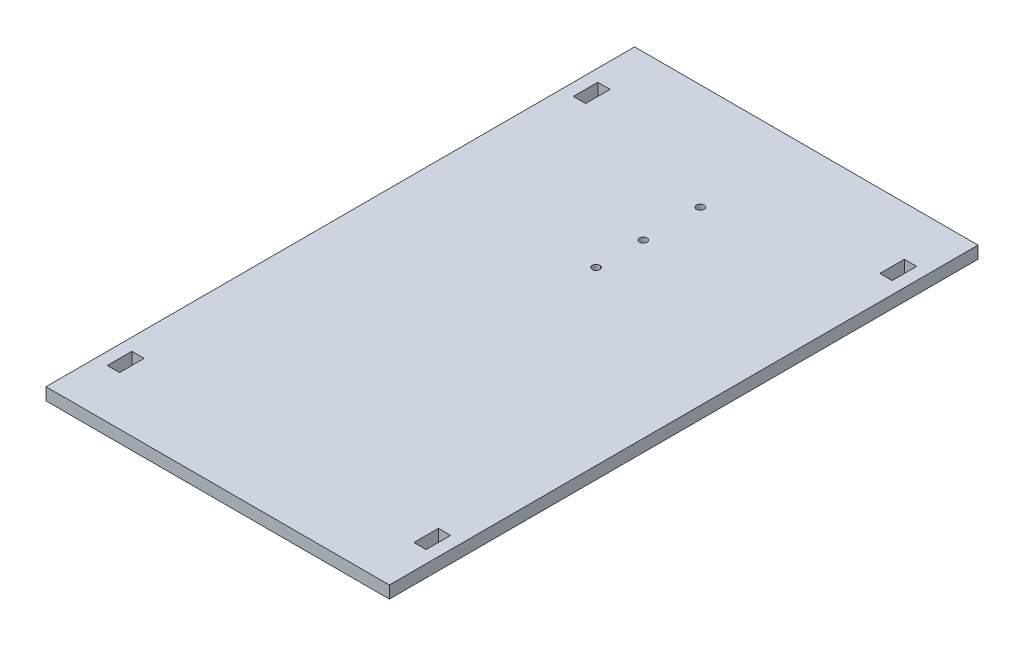
ISO-10303-21;
HEADER;
FILE_DESCRIPTION(('STEP AP214'),'2;1');
FILE_NAME('part.step','',(''),(''),'','','');
FILE_SCHEMA(('AUTOMOTIVE_DESIGN { 1 0 10303 214 1 1 1 1 }'));
ENDSEC;
DATA;
#1=APPLICATION_CONTEXT('core data for automotive mechanical design processes');
#2=APPLICATION_PROTOCOL_DEFINITION('international standard','automotive_design',2000,#1);
#3=PRODUCT_CONTEXT('',#1,'mechanical');
#4=PRODUCT('Part','Part','',(#3));
#5=PRODUCT_RELATED_PRODUCT_CATEGORY('part','',(#4));
#6=PRODUCT_DEFINITION_FORMATION('','',#4);
#7=PRODUCT_DEFINITION_CONTEXT('part definition',#1,'design');
#8=PRODUCT_DEFINITION('design','',#6,#7);
#9=PRODUCT_DEFINITION_SHAPE('','',#8);
#10=(LENGTH_UNIT() NAMED_UNIT(*) SI_UNIT(.MILLI.,.METRE.));
#11=(NAMED_UNIT(*) PLANE_ANGLE_UNIT() SI_UNIT($,.RADIAN.));
#12=(NAMED_UNIT(*) SI_UNIT($,.STERADIAN.) SOLID_ANGLE_UNIT());
#13=UNCERTAINTY_MEASURE_WITH_UNIT(LENGTH_MEASURE(1.E-05),#10,'distance_accuracy_value','');
#14=(GEOMETRIC_REPRESENTATION_CONTEXT(3) GLOBAL_UNCERTAINTY_ASSIGNED_CONTEXT((#13)) GLOBAL_UNIT_ASSIGNED_CONTEXT((#10,
#11,#12)) REPRESENTATION_CONTEXT('',''));
#15=CARTESIAN_POINT('',(0.,0.,0.));
#16=DIRECTION('',(0.,0.,1.));
#17=DIRECTION('',(1.,0.,0.));
#18=AXIS2_PLACEMENT_3D('',#15,#16,#17);
#19=CARTESIAN_POINT('',(171.45,6.35,-3.7470027081099E-13));
#20=DIRECTION('',(1.,0.,0.));
#21=DIRECTION('',(0.,0.,-1.));
#22=AXIS2_PLACEMENT_3D('',#19,#20,#21);
#23=PLANE('',#22);
#24=DIRECTION('',(0.,0.,1.));
#25=VECTOR('',#24,1.);
#26=CARTESIAN_POINT('',(171.45,0.,-3.7470027081099E-13));
#27=LINE('',#26,#25);
#28=CARTESIAN_POINT('',(171.45,0.,-38.1000000000001));
#29=VERTEX_POINT('',#28);
#30=CARTESIAN_POINT('',(171.45,0.,-25.4000000000001));
#31=VERTEX_POINT('',#30);
#32=EDGE_CURVE('E260',#29,#31,#27,.T.);
#33=ORIENTED_EDGE('',*,*,#32,.T.);
#34=DIRECTION('',(0.,-1.,0.));
#35=VECTOR('',#34,1.);
#36=CARTESIAN_POINT('',(171.45,6.35,-25.4000000000001));
#37=LINE('',#36,#35);
#38=CARTESIAN_POINT('',(171.45,6.35,-25.4000000000001));
#39=VERTEX_POINT('',#38);
#40=EDGE_CURVE('E11',#39,#31,#37,.T.);
#41=ORIENTED_EDGE('',*,*,#40,.F.);
#42=DIRECTION('',(0.,0.,1.));
#43=VECTOR('',#42,1.);
#44=CARTESIAN_POINT('',(171.45,6.35,-3.7470027081099E-13));
#45=LINE('',#44,#43);
#46=CARTESIAN_POINT('',(171.45,6.35,-38.1000000000001));
#47=VERTEX_POINT('',#46);
#48=EDGE_CURVE('E186',#47,#39,#45,.T.);
#49=ORIENTED_EDGE('',*,*,#48,.F.);
#50=DIRECTION('',(0.,-1.,0.));
#51=VECTOR('',#50,1.);
#52=CARTESIAN_POINT('',(171.45,6.35,-38.1000000000001));
#53=LINE('',#52,#51);
#54=EDGE_CURVE('E54',#47,#29,#53,.T.);
#55=ORIENTED_EDGE('',*,*,#54,.T.);
#56=EDGE_LOOP('',(#33,#41,#49,#55));
#57=FACE_BOUND('',#56,.T.);
#58=ADVANCED_FACE('F35',(#57),#23,.F.);
#59=CARTESIAN_POINT('',(0.,6.35,-25.4000000000001));
#60=DIRECTION('',(0.,0.,1.));
#61=DIRECTION('',(1.,0.,0.));
#62=AXIS2_PLACEMENT_3D('',#59,#60,#61);
#63=PLANE('',#62);
#64=DIRECTION('',(-1.,0.,0.));
#65=VECTOR('',#64,1.);
#66=CARTESIAN_POINT('',(0.,0.,-25.4000000000001));
#67=LINE('',#66,#65);
#68=CARTESIAN_POINT('',(165.1,0.,-25.4000000000001));
#69=VERTEX_POINT('',#68);
#70=EDGE_CURVE('E192',#31,#69,#67,.T.);
#71=ORIENTED_EDGE('',*,*,#70,.T.);
#72=DIRECTION('',(0.,-1.,0.));
#73=VECTOR('',#72,1.);
#74=CARTESIAN_POINT('',(165.1,6.35,-25.4000000000001));
#75=LINE('',#74,#73);
#76=CARTESIAN_POINT('',(165.1,6.35,-25.4000000000001));
#77=VERTEX_POINT('',#76);
#78=EDGE_CURVE('E45',#77,#69,#75,.T.);
#79=ORIENTED_EDGE('',*,*,#78,.F.);
#80=DIRECTION('',(-1.,0.,0.));
#81=VECTOR('',#80,1.);
#82=CARTESIAN_POINT('',(0.,6.35,-25.4000000000001));
#83=LINE('',#82,#81);
#84=EDGE_CURVE('E180',#39,#77,#83,.T.);
#85=ORIENTED_EDGE('',*,*,#84,.F.);
#86=ORIENTED_EDGE('',*,*,#40,.T.);
#87=EDGE_LOOP('',(#71,#79,#85,#86));
#88=FACE_BOUND('',#87,.T.);
#89=ADVANCED_FACE('F191',(#88),#63,.F.);
#90=CARTESIAN_POINT('',(165.1,6.35,0.));
#91=DIRECTION('',(1.,0.,0.));
#92=DIRECTION('',(0.,0.,-1.));
#93=AXIS2_PLACEMENT_3D('',#90,#91,#92);
#94=PLANE('',#93);
#95=DIRECTION('',(0.,0.,1.));
#96=VECTOR('',#95,1.);
#97=CARTESIAN_POINT('',(165.1,0.,0.));
#98=LINE('',#97,#96);
#99=CARTESIAN_POINT('',(165.1,0.,-38.1000000000001));
#100=VERTEX_POINT('',#99);
#101=EDGE_CURVE('E263',#100,#69,#98,.T.);
#102=ORIENTED_EDGE('',*,*,#101,.F.);
#103=DIRECTION('',(0.,-1.,0.));
#104=VECTOR('',#103,1.);
#105=CARTESIAN_POINT('',(165.1,6.35,-38.1000000000001));
#106=LINE('',#105,#104);
#107=CARTESIAN_POINT('',(165.1,6.35,-38.1000000000001));
#108=VERTEX_POINT('',#107);
#109=EDGE_CURVE('E116',#108,#100,#106,.T.);
#110=ORIENTED_EDGE('',*,*,#109,.F.);
#111=DIRECTION('',(0.,0.,1.));
#112=VECTOR('',#111,1.);
#113=CARTESIAN_POINT('',(165.1,6.35,0.));
#114=LINE('',#113,#112);
#115=EDGE_CURVE('E185',#108,#77,#114,.T.);
#116=ORIENTED_EDGE('',*,*,#115,.T.);
#117=ORIENTED_EDGE('',*,*,#78,.T.);
#118=EDGE_LOOP('',(#102,#110,#116,#117));
#119=FACE_BOUND('',#118,.T.);
#120=ADVANCED_FACE('F196',(#119),#94,.T.);
#121=CARTESIAN_POINT('',(0.,6.35,-25.4));
#122=DIRECTION('',(0.,0.,-1.));
#123=DIRECTION('',(-1.,0.,0.));
#124=AXIS2_PLACEMENT_3D('',#121,#122,#123);
#125=PLANE('',#124);
#126=DIRECTION('',(1.,0.,0.));
#127=VECTOR('',#126,1.);
#128=CARTESIAN_POINT('',(0.,0.,-25.4));
#129=LINE('',#128,#127);
#130=CARTESIAN_POINT('',(6.35,0.,-25.4));
#131=VERTEX_POINT('',#130);
#132=CARTESIAN_POINT('',(12.7,0.,-25.4));
#133=VERTEX_POINT('',#132);
#134=EDGE_CURVE('E248',#131,#133,#129,.T.);
#135=ORIENTED_EDGE('',*,*,#134,.F.);
#136=DIRECTION('',(0.,-1.,0.));
#137=VECTOR('',#136,1.);
#138=CARTESIAN_POINT('',(6.35,6.35,-25.4));
#139=LINE('',#138,#137);
#140=CARTESIAN_POINT('',(6.35,6.35,-25.4));
#141=VERTEX_POINT('',#140);
#142=EDGE_CURVE('E270',#141,#131,#139,.T.);
#143=ORIENTED_EDGE('',*,*,#142,.F.);
#144=DIRECTION('',(1.,0.,0.));
#145=VECTOR('',#144,1.);
#146=CARTESIAN_POINT('',(0.,6.35,-25.4));
#147=LINE('',#146,#145);
#148=CARTESIAN_POINT('',(12.7,6.35,-25.4));
#149=VERTEX_POINT('',#148);
#150=EDGE_CURVE('E353',#141,#149,#147,.T.);
#151=ORIENTED_EDGE('',*,*,#150,.T.);
#152=DIRECTION('',(0.,-1.,0.));
#153=VECTOR('',#152,1.);
#154=CARTESIAN_POINT('',(12.7,6.35,-25.4));
#155=LINE('',#154,#153);
#156=EDGE_CURVE('E272',#149,#133,#155,.T.);
#157=ORIENTED_EDGE('',*,*,#156,.T.);
#158=EDGE_LOOP('',(#135,#143,#151,#157));
#159=FACE_BOUND('',#158,.T.);
#160=ADVANCED_FACE('F373',(#159),#125,.T.);
#161=CARTESIAN_POINT('',(6.35000000000002,6.35,0.));
#162=DIRECTION('',(1.,0.,0.));
#163=DIRECTION('',(0.,0.,-1.));
#164=AXIS2_PLACEMENT_3D('',#161,#162,#163);
#165=PLANE('',#164);
#166=DIRECTION('',(0.,0.,1.));
#167=VECTOR('',#166,1.);
#168=CARTESIAN_POINT('',(6.35000000000002,0.,0.));
#169=LINE('',#168,#167);
#170=CARTESIAN_POINT('',(6.34999999999999,0.,-38.1000000000001));
#171=VERTEX_POINT('',#170);
#172=EDGE_CURVE('E251',#171,#131,#169,.T.);
#173=ORIENTED_EDGE('',*,*,#172,.F.);
#174=DIRECTION('',(0.,-1.,0.));
#175=VECTOR('',#174,1.);
#176=CARTESIAN_POINT('',(6.34999999999999,6.35,-38.1000000000001));
#177=LINE('',#176,#175);
#178=CARTESIAN_POINT('',(6.34999999999999,6.35,-38.1000000000001));
#179=VERTEX_POINT('',#178);
#180=EDGE_CURVE('E278',#179,#171,#177,.T.);
#181=ORIENTED_EDGE('',*,*,#180,.F.);
#182=DIRECTION('',(0.,0.,1.));
#183=VECTOR('',#182,1.);
#184=CARTESIAN_POINT('',(6.35000000000002,6.35,0.));
#185=LINE('',#184,#183);
#186=EDGE_CURVE('E356',#179,#141,#185,.T.);
#187=ORIENTED_EDGE('',*,*,#186,.T.);
#188=ORIENTED_EDGE('',*,*,#142,.T.);
#189=EDGE_LOOP('',(#173,#181,#187,#188));
#190=FACE_BOUND('',#189,.T.);
#191=ADVANCED_FACE('F376',(#190),#165,.T.);
#192=CARTESIAN_POINT('',(0.,6.35,-38.1000000000001));
#193=DIRECTION('',(0.,0.,-1.));
#194=DIRECTION('',(-1.,0.,0.));
#195=AXIS2_PLACEMENT_3D('',#192,#193,#194);
#196=PLANE('',#195);
#197=DIRECTION('',(1.,0.,0.));
#198=VECTOR('',#197,1.);
#199=CARTESIAN_POINT('',(0.,0.,-38.1000000000001));
#200=LINE('',#199,#198);
#201=CARTESIAN_POINT('',(12.7,0.,-38.1000000000001));
#202=VERTEX_POINT('',#201);
#203=EDGE_CURVE('E254',#171,#202,#200,.T.);
#204=ORIENTED_EDGE('',*,*,#203,.T.);
#205=DIRECTION('',(0.,-1.,0.));
#206=VECTOR('',#205,1.);
#207=CARTESIAN_POINT('',(12.7,6.35,-38.1000000000001));
#208=LINE('',#207,#206);
#209=CARTESIAN_POINT('',(12.7,6.35,-38.1000000000001));
#210=VERTEX_POINT('',#209);
#211=EDGE_CURVE('E274',#210,#202,#208,.T.);
#212=ORIENTED_EDGE('',*,*,#211,.F.);
#213=DIRECTION('',(1.,0.,0.));
#214=VECTOR('',#213,1.);
#215=CARTESIAN_POINT('',(0.,6.35,-38.1000000000001));
#216=LINE('',#215,#214);
#217=EDGE_CURVE('E359',#179,#210,#216,.T.);
#218=ORIENTED_EDGE('',*,*,#217,.F.);
#219=ORIENTED_EDGE('',*,*,#180,.T.);
#220=EDGE_LOOP('',(#204,#212,#218,#219));
#221=FACE_BOUND('',#220,.T.);
#222=ADVANCED_FACE('F379',(#221),#196,.F.);
#223=CARTESIAN_POINT('',(0.,6.35,-266.7));
#224=DIRECTION('',(0.,0.,-1.));
#225=DIRECTION('',(-1.,0.,0.));
#226=AXIS2_PLACEMENT_3D('',#223,#224,#225);
#227=PLANE('',#226);
#228=DIRECTION('',(1.,0.,0.));
#229=VECTOR('',#228,1.);
#230=CARTESIAN_POINT('',(0.,0.,-266.7));
#231=LINE('',#230,#229);
#232=CARTESIAN_POINT('',(6.35000000000005,0.,-266.7));
#233=VERTEX_POINT('',#232);
#234=CARTESIAN_POINT('',(12.6999999999999,0.,-266.7));
#235=VERTEX_POINT('',#234);
#236=EDGE_CURVE('E236',#233,#235,#231,.T.);
#237=ORIENTED_EDGE('',*,*,#236,.F.);
#238=DIRECTION('',(0.,-1.,0.));
#239=VECTOR('',#238,1.);
#240=CARTESIAN_POINT('',(6.35000000000005,6.35,-266.7));
#241=LINE('',#240,#239);
#242=CARTESIAN_POINT('',(6.35000000000005,6.35,-266.7));
#243=VERTEX_POINT('',#242);
#244=EDGE_CURVE('E275',#243,#233,#241,.T.);
#245=ORIENTED_EDGE('',*,*,#244,.F.);
#246=DIRECTION('',(1.,0.,0.));
#247=VECTOR('',#246,1.);
#248=CARTESIAN_POINT('',(0.,6.35,-266.7));
#249=LINE('',#248,#247);
#250=CARTESIAN_POINT('',(12.6999999999999,6.35,-266.7));
#251=VERTEX_POINT('',#250);
#252=EDGE_CURVE('E342',#243,#251,#249,.T.);
#253=ORIENTED_EDGE('',*,*,#252,.T.);
#254=DIRECTION('',(0.,-1.,0.));
#255=VECTOR('',#254,1.);
#256=CARTESIAN_POINT('',(12.6999999999999,6.35,-266.7));
#257=LINE('',#256,#255);
#258=EDGE_CURVE('E281',#251,#235,#257,.T.);
#259=ORIENTED_EDGE('',*,*,#258,.T.);
#260=EDGE_LOOP('',(#237,#245,#253,#259));
#261=FACE_BOUND('',#260,.T.);
#262=ADVANCED_FACE('F409',(#261),#227,.T.);
#263=CARTESIAN_POINT('',(6.35000000000018,6.35,0.));
#264=DIRECTION('',(1.,0.,0.));
#265=DIRECTION('',(0.,0.,-1.));
#266=AXIS2_PLACEMENT_3D('',#263,#264,#265);
#267=PLANE('',#266);
#268=DIRECTION('',(0.,0.,1.));
#269=VECTOR('',#268,1.);
#270=CARTESIAN_POINT('',(6.35000000000018,0.,0.));
#271=LINE('',#270,#269);
#272=CARTESIAN_POINT('',(6.35000000000004,0.,-279.4));
#273=VERTEX_POINT('',#272);
#274=EDGE_CURVE('E239',#273,#233,#271,.T.);
#275=ORIENTED_EDGE('',*,*,#274,.F.);
#276=DIRECTION('',(0.,-1.,0.));
#277=VECTOR('',#276,1.);
#278=CARTESIAN_POINT('',(6.35000000000004,6.35,-279.4));
#279=LINE('',#278,#277);
#280=CARTESIAN_POINT('',(6.35000000000004,6.35,-279.4));
#281=VERTEX_POINT('',#280);
#282=EDGE_CURVE('E287',#281,#273,#279,.T.);
#283=ORIENTED_EDGE('',*,*,#282,.F.);
#284=DIRECTION('',(0.,0.,1.));
#285=VECTOR('',#284,1.);
#286=CARTESIAN_POINT('',(6.35000000000018,6.35,0.));
#287=LINE('',#286,#285);
#288=EDGE_CURVE('E345',#281,#243,#287,.T.);
#289=ORIENTED_EDGE('',*,*,#288,.T.);
#290=ORIENTED_EDGE('',*,*,#244,.T.);
#291=EDGE_LOOP('',(#275,#283,#289,#290));
#292=FACE_BOUND('',#291,.T.);
#293=ADVANCED_FACE('F422',(#292),#267,.T.);
#294=CARTESIAN_POINT('',(0.,6.35,-279.4));
#295=DIRECTION('',(0.,0.,-1.));
#296=DIRECTION('',(-1.,0.,0.));
#297=AXIS2_PLACEMENT_3D('',#294,#295,#296);
#298=PLANE('',#297);
#299=DIRECTION('',(1.,0.,0.));
#300=VECTOR('',#299,1.);
#301=CARTESIAN_POINT('',(0.,0.,-279.4));
#302=LINE('',#301,#300);
#303=CARTESIAN_POINT('',(12.7,0.,-279.4));
#304=VERTEX_POINT('',#303);
#305=EDGE_CURVE('E242',#273,#304,#302,.T.);
#306=ORIENTED_EDGE('',*,*,#305,.T.);
#307=DIRECTION('',(0.,-1.,0.));
#308=VECTOR('',#307,1.);
#309=CARTESIAN_POINT('',(12.7,6.35,-279.4));
#310=LINE('',#309,#308);
#311=CARTESIAN_POINT('',(12.7,6.35,-279.4));
#312=VERTEX_POINT('',#311);
#313=EDGE_CURVE('E283',#312,#304,#310,.T.);
#314=ORIENTED_EDGE('',*,*,#313,.F.);
#315=DIRECTION('',(1.,0.,0.));
#316=VECTOR('',#315,1.);
#317=CARTESIAN_POINT('',(0.,6.35,-279.4));
#318=LINE('',#317,#316);
#319=EDGE_CURVE('E348',#281,#312,#318,.T.);
#320=ORIENTED_EDGE('',*,*,#319,.F.);
#321=ORIENTED_EDGE('',*,*,#282,.T.);
#322=EDGE_LOOP('',(#306,#314,#320,#321));
#323=FACE_BOUND('',#322,.T.);
#324=ADVANCED_FACE('F418',(#323),#298,.F.);
#325=CARTESIAN_POINT('',(-2.33146835171288E-12,6.35,-266.699999999999));
#326=DIRECTION('',(0.,0.,-1.));
#327=DIRECTION('',(-1.,0.,0.));
#328=AXIS2_PLACEMENT_3D('',#325,#326,#327);
#329=PLANE('',#328);
#330=DIRECTION('',(1.,0.,0.));
#331=VECTOR('',#330,1.);
#332=CARTESIAN_POINT('',(-2.33146835171288E-12,0.,-266.699999999999));
#333=LINE('',#332,#331);
#334=CARTESIAN_POINT('',(165.1,0.,-266.7));
#335=VERTEX_POINT('',#334);
#336=CARTESIAN_POINT('',(171.45,0.,-266.7));
#337=VERTEX_POINT('',#336);
#338=EDGE_CURVE('E224',#335,#337,#333,.T.);
#339=ORIENTED_EDGE('',*,*,#338,.F.);
#340=DIRECTION('',(0.,-1.,0.));
#341=VECTOR('',#340,1.);
#342=CARTESIAN_POINT('',(165.1,6.35,-266.7));
#343=LINE('',#342,#341);
#344=CARTESIAN_POINT('',(165.1,6.35,-266.7));
#345=VERTEX_POINT('',#344);
#346=EDGE_CURVE('E284',#345,#335,#343,.T.);
#347=ORIENTED_EDGE('',*,*,#346,.F.);
#348=DIRECTION('',(1.,0.,0.));
#349=VECTOR('',#348,1.);
#350=CARTESIAN_POINT('',(-2.33146835171288E-12,6.35,-266.699999999999));
#351=LINE('',#350,#349);
#352=CARTESIAN_POINT('',(171.45,6.35,-266.7));
#353=VERTEX_POINT('',#352);
#354=EDGE_CURVE('E324',#345,#353,#351,.T.);
#355=ORIENTED_EDGE('',*,*,#354,.T.);
#356=DIRECTION('',(0.,-1.,0.));
#357=VECTOR('',#356,1.);
#358=CARTESIAN_POINT('',(171.45,6.35,-266.7));
#359=LINE('',#358,#357);
#360=EDGE_CURVE('E290',#353,#337,#359,.T.);
#361=ORIENTED_EDGE('',*,*,#360,.T.);
#362=EDGE_LOOP('',(#339,#347,#355,#361));
#363=FACE_BOUND('',#362,.T.);
#364=ADVANCED_FACE('F421',(#363),#329,.T.);
#365=CARTESIAN_POINT('',(165.100000000001,6.35,-1.08246744900954E-12));
#366=DIRECTION('',(1.,0.,0.));
#367=DIRECTION('',(0.,0.,-1.));
#368=AXIS2_PLACEMENT_3D('',#365,#366,#367);
#369=PLANE('',#368);
#370=DIRECTION('',(0.,0.,1.));
#371=VECTOR('',#370,1.);
#372=CARTESIAN_POINT('',(165.100000000001,0.,-1.08246744900954E-12));
#373=LINE('',#372,#371);
#374=CARTESIAN_POINT('',(165.1,0.,-279.4));
#375=VERTEX_POINT('',#374);
#376=EDGE_CURVE('E227',#375,#335,#373,.T.);
#377=ORIENTED_EDGE('',*,*,#376,.F.);
#378=DIRECTION('',(0.,-1.,0.));
#379=VECTOR('',#378,1.);
#380=CARTESIAN_POINT('',(165.1,6.35,-279.4));
#381=LINE('',#380,#379);
#382=CARTESIAN_POINT('',(165.1,6.35,-279.4));
#383=VERTEX_POINT('',#382);
#384=EDGE_CURVE('E295',#383,#375,#381,.T.);
#385=ORIENTED_EDGE('',*,*,#384,.F.);
#386=DIRECTION('',(0.,0.,1.));
#387=VECTOR('',#386,1.);
#388=CARTESIAN_POINT('',(165.100000000001,6.35,-1.08246744900954E-12));
#389=LINE('',#388,#387);
#390=EDGE_CURVE('E334',#383,#345,#389,.T.);
#391=ORIENTED_EDGE('',*,*,#390,.T.);
#392=ORIENTED_EDGE('',*,*,#346,.T.);
#393=EDGE_LOOP('',(#377,#385,#391,#392));
#394=FACE_BOUND('',#393,.T.);
#395=ADVANCED_FACE('F436',(#394),#369,.T.);
#396=CARTESIAN_POINT('',(0.,6.35,-279.4));
#397=DIRECTION('',(0.,0.,-1.));
#398=DIRECTION('',(-1.,0.,0.));
#399=AXIS2_PLACEMENT_3D('',#396,#397,#398);
#400=PLANE('',#399);
#401=DIRECTION('',(1.,0.,0.));
#402=VECTOR('',#401,1.);
#403=CARTESIAN_POINT('',(0.,0.,-279.4));
#404=LINE('',#403,#402);
#405=CARTESIAN_POINT('',(171.45,0.,-279.4));
#406=VERTEX_POINT('',#405);
#407=EDGE_CURVE('E230',#375,#406,#404,.T.);
#408=ORIENTED_EDGE('',*,*,#407,.T.);
#409=DIRECTION('',(0.,-1.,0.));
#410=VECTOR('',#409,1.);
#411=CARTESIAN_POINT('',(171.45,6.35,-279.4));
#412=LINE('',#411,#410);
#413=CARTESIAN_POINT('',(171.45,6.35,-279.4));
#414=VERTEX_POINT('',#413);
#415=EDGE_CURVE('E292',#414,#406,#412,.T.);
#416=ORIENTED_EDGE('',*,*,#415,.F.);
#417=DIRECTION('',(1.,0.,0.));
#418=VECTOR('',#417,1.);
#419=CARTESIAN_POINT('',(0.,6.35,-279.4));
#420=LINE('',#419,#418);
#421=EDGE_CURVE('E337',#383,#414,#420,.T.);
#422=ORIENTED_EDGE('',*,*,#421,.F.);
#423=ORIENTED_EDGE('',*,*,#384,.T.);
#424=EDGE_LOOP('',(#408,#416,#422,#423));
#425=FACE_BOUND('',#424,.T.);
#426=ADVANCED_FACE('F433',(#425),#400,.F.);
#427=CARTESIAN_POINT('',(0.,6.35,-304.8));
#428=DIRECTION('',(0.,0.,-1.));
#429=DIRECTION('',(-1.,0.,0.));
#430=AXIS2_PLACEMENT_3D('',#427,#428,#429);
#431=PLANE('',#430);
#432=DIRECTION('',(1.,0.,0.));
#433=VECTOR('',#432,1.);
#434=CARTESIAN_POINT('',(0.,0.,-304.8));
#435=LINE('',#434,#433);
#436=CARTESIAN_POINT('',(0.,0.,-304.8));
#437=VERTEX_POINT('',#436);
#438=CARTESIAN_POINT('',(177.8,0.,-304.8));
#439=VERTEX_POINT('',#438);
#440=EDGE_CURVE('E212',#437,#439,#435,.T.);
#441=ORIENTED_EDGE('',*,*,#440,.F.);
#442=DIRECTION('',(0.,-1.,0.));
#443=VECTOR('',#442,1.);
#444=CARTESIAN_POINT('',(0.,6.35,-304.8));
#445=LINE('',#444,#443);
#446=CARTESIAN_POINT('',(0.,6.35,-304.8));
#447=VERTEX_POINT('',#446);
#448=EDGE_CURVE('E39',#447,#437,#445,.T.);
#449=ORIENTED_EDGE('',*,*,#448,.F.);
#450=DIRECTION('',(1.,0.,0.));
#451=VECTOR('',#450,1.);
#452=CARTESIAN_POINT('',(0.,6.35,-304.8));
#453=LINE('',#452,#451);
#454=CARTESIAN_POINT('',(177.8,6.35,-304.8));
#455=VERTEX_POINT('',#454);
#456=EDGE_CURVE('E328',#447,#455,#453,.T.);
#457=ORIENTED_EDGE('',*,*,#456,.T.);
#458=DIRECTION('',(0.,-1.,0.));
#459=VECTOR('',#458,1.);
#460=CARTESIAN_POINT('',(177.8,6.35,-304.8));
#461=LINE('',#460,#459);
#462=EDGE_CURVE('E199',#455,#439,#461,.T.);
#463=ORIENTED_EDGE('',*,*,#462,.T.);
#464=EDGE_LOOP('',(#441,#449,#457,#463));
#465=FACE_BOUND('',#464,.T.);
#466=ADVANCED_FACE('F311',(#465),#431,.T.);
#467=CARTESIAN_POINT('',(0.,6.35,0.));
#468=DIRECTION('',(-1.,0.,0.));
#469=DIRECTION('',(0.,0.,1.));
#470=AXIS2_PLACEMENT_3D('',#467,#468,#469);
#471=PLANE('',#470);
#472=DIRECTION('',(0.,0.,-1.));
#473=VECTOR('',#472,1.);
#474=CARTESIAN_POINT('',(0.,0.,0.));
#475=LINE('',#474,#473);
#476=CARTESIAN_POINT('',(0.,0.,0.));
#477=VERTEX_POINT('',#476);
#478=EDGE_CURVE('E215',#477,#437,#475,.T.);
#479=ORIENTED_EDGE('',*,*,#478,.F.);
#480=DIRECTION('',(0.,-1.,0.));
#481=VECTOR('',#480,1.);
#482=CARTESIAN_POINT('',(0.,6.35,0.));
#483=LINE('',#482,#481);
#484=CARTESIAN_POINT('',(0.,6.35,0.));
#485=VERTEX_POINT('',#484);
#486=EDGE_CURVE('E301',#485,#477,#483,.T.);
#487=ORIENTED_EDGE('',*,*,#486,.F.);
#488=DIRECTION('',(0.,0.,-1.));
#489=VECTOR('',#488,1.);
#490=CARTESIAN_POINT('',(0.,6.35,0.));
#491=LINE('',#490,#489);
#492=EDGE_CURVE('E310',#485,#447,#491,.T.);
#493=ORIENTED_EDGE('',*,*,#492,.T.);
#494=ORIENTED_EDGE('',*,*,#448,.T.);
#495=EDGE_LOOP('',(#479,#487,#493,#494));
#496=FACE_BOUND('',#495,.T.);
#497=ADVANCED_FACE('F308',(#496),#471,.T.);
#498=CARTESIAN_POINT('',(0.,6.35,0.));
#499=DIRECTION('',(0.,0.,-1.));
#500=DIRECTION('',(-1.,0.,0.));
#501=AXIS2_PLACEMENT_3D('',#498,#499,#500);
#502=PLANE('',#501);
#503=DIRECTION('',(1.,0.,0.));
#504=VECTOR('',#503,1.);
#505=CARTESIAN_POINT('',(0.,0.,0.));
#506=LINE('',#505,#504);
#507=CARTESIAN_POINT('',(177.8,0.,0.));
#508=VERTEX_POINT('',#507);
#509=EDGE_CURVE('E218',#477,#508,#506,.T.);
#510=ORIENTED_EDGE('',*,*,#509,.T.);
#511=DIRECTION('',(0.,-1.,0.));
#512=VECTOR('',#511,1.);
#513=CARTESIAN_POINT('',(177.8,6.35,0.));
#514=LINE('',#513,#512);
#515=CARTESIAN_POINT('',(177.8,6.35,0.));
#516=VERTEX_POINT('',#515);
#517=EDGE_CURVE('E299',#516,#508,#514,.T.);
#518=ORIENTED_EDGE('',*,*,#517,.F.);
#519=DIRECTION('',(1.,0.,0.));
#520=VECTOR('',#519,1.);
#521=CARTESIAN_POINT('',(0.,6.35,0.));
#522=LINE('',#521,#520);
#523=EDGE_CURVE('E319',#485,#516,#522,.T.);
#524=ORIENTED_EDGE('',*,*,#523,.F.);
#525=ORIENTED_EDGE('',*,*,#486,.T.);
#526=EDGE_LOOP('',(#510,#518,#524,#525));
#527=FACE_BOUND('',#526,.T.);
#528=ADVANCED_FACE('F317',(#527),#502,.F.);
#529=CARTESIAN_POINT('',(12.7,6.35,0.));
#530=DIRECTION('',(1.,0.,0.));
#531=DIRECTION('',(0.,0.,-1.));
#532=AXIS2_PLACEMENT_3D('',#529,#530,#531);
#533=PLANE('',#532);
#534=DIRECTION('',(0.,0.,1.));
#535=VECTOR('',#534,1.);
#536=CARTESIAN_POINT('',(12.7,0.,0.));
#537=LINE('',#536,#535);
#538=EDGE_CURVE('E257',#202,#133,#537,.T.);
#539=ORIENTED_EDGE('',*,*,#538,.T.);
#540=ORIENTED_EDGE('',*,*,#156,.F.);
#541=DIRECTION('',(0.,0.,1.));
#542=VECTOR('',#541,1.);
#543=CARTESIAN_POINT('',(12.7,6.35,0.));
#544=LINE('',#543,#542);
#545=EDGE_CURVE('E362',#210,#149,#544,.T.);
#546=ORIENTED_EDGE('',*,*,#545,.F.);
#547=ORIENTED_EDGE('',*,*,#211,.T.);
#548=EDGE_LOOP('',(#539,#540,#546,#547));
#549=FACE_BOUND('',#548,.T.);
#550=ADVANCED_FACE('F370',(#549),#533,.F.);
#551=CARTESIAN_POINT('',(12.6999999999974,6.35,1.17961196366399E-13));
#552=DIRECTION('',(1.,0.,0.));
#553=DIRECTION('',(0.,0.,-1.));
#554=AXIS2_PLACEMENT_3D('',#551,#552,#553);
#555=PLANE('',#554);
#556=DIRECTION('',(0.,0.,1.));
#557=VECTOR('',#556,1.);
#558=CARTESIAN_POINT('',(12.6999999999974,0.,1.17961196366399E-13));
#559=LINE('',#558,#557);
#560=EDGE_CURVE('E245',#304,#235,#559,.T.);
#561=ORIENTED_EDGE('',*,*,#560,.T.);
#562=ORIENTED_EDGE('',*,*,#258,.F.);
#563=DIRECTION('',(0.,0.,1.));
#564=VECTOR('',#563,1.);
#565=CARTESIAN_POINT('',(12.6999999999974,6.35,1.17961196366399E-13));
#566=LINE('',#565,#564);
#567=EDGE_CURVE('E351',#312,#251,#566,.T.);
#568=ORIENTED_EDGE('',*,*,#567,.F.);
#569=ORIENTED_EDGE('',*,*,#313,.T.);
#570=EDGE_LOOP('',(#561,#562,#568,#569));
#571=FACE_BOUND('',#570,.T.);
#572=ADVANCED_FACE('F406',(#571),#555,.F.);
#573=CARTESIAN_POINT('',(171.449999999999,6.35,3.7470027081099E-13));
#574=DIRECTION('',(1.,0.,0.));
#575=DIRECTION('',(0.,0.,-1.));
#576=AXIS2_PLACEMENT_3D('',#573,#574,#575);
#577=PLANE('',#576);
#578=DIRECTION('',(0.,0.,1.));
#579=VECTOR('',#578,1.);
#580=CARTESIAN_POINT('',(171.449999999999,0.,3.7470027081099E-13));
#581=LINE('',#580,#579);
#582=EDGE_CURVE('E233',#406,#337,#581,.T.);
#583=ORIENTED_EDGE('',*,*,#582,.T.);
#584=ORIENTED_EDGE('',*,*,#360,.F.);
#585=DIRECTION('',(0.,0.,1.));
#586=VECTOR('',#585,1.);
#587=CARTESIAN_POINT('',(171.449999999999,6.35,3.7470027081099E-13));
#588=LINE('',#587,#586);
#589=EDGE_CURVE('E340',#414,#353,#588,.T.);
#590=ORIENTED_EDGE('',*,*,#589,.F.);
#591=ORIENTED_EDGE('',*,*,#415,.T.);
#592=EDGE_LOOP('',(#583,#584,#590,#591));
#593=FACE_BOUND('',#592,.T.);
#594=ADVANCED_FACE('F416',(#593),#577,.F.);
#595=CARTESIAN_POINT('',(177.8,6.35,0.));
#596=DIRECTION('',(-1.,0.,0.));
#597=DIRECTION('',(0.,0.,1.));
#598=AXIS2_PLACEMENT_3D('',#595,#596,#597);
#599=PLANE('',#598);
#600=DIRECTION('',(0.,0.,-1.));
#601=VECTOR('',#600,1.);
#602=CARTESIAN_POINT('',(177.8,0.,0.));
#603=LINE('',#602,#601);
#604=EDGE_CURVE('E221',#508,#439,#603,.T.);
#605=ORIENTED_EDGE('',*,*,#604,.T.);
#606=ORIENTED_EDGE('',*,*,#462,.F.);
#607=DIRECTION('',(0.,0.,-1.));
#608=VECTOR('',#607,1.);
#609=CARTESIAN_POINT('',(177.8,6.35,0.));
#610=LINE('',#609,#608);
#611=EDGE_CURVE('E322',#516,#455,#610,.T.);
#612=ORIENTED_EDGE('',*,*,#611,.F.);
#613=ORIENTED_EDGE('',*,*,#517,.T.);
#614=EDGE_LOOP('',(#605,#606,#612,#613));
#615=FACE_BOUND('',#614,.T.);
#616=ADVANCED_FACE('F321',(#615),#599,.F.);
#617=CARTESIAN_POINT('',(88.9,6.35,-249.900000072));
#618=DIRECTION('',(0.,-1.,0.));
#619=DIRECTION('',(0.,0.,-1.));
#620=AXIS2_PLACEMENT_3D('',#617,#618,#619);
#621=CYLINDRICAL_SURFACE('',#620,1.93499994);
#622=CARTESIAN_POINT('',(88.9,6.35,-249.900000072));
#623=DIRECTION('',(0.,1.,0.));
#624=DIRECTION('',(0.,0.,1.));
#625=AXIS2_PLACEMENT_3D('',#622,#623,#624);
#626=CIRCLE('',#625,1.93499994);
#627=CARTESIAN_POINT('',(88.9,6.35,-247.965000132));
#628=VERTEX_POINT('',#627);
#629=EDGE_CURVE('E469',#628,#628,#626,.T.);
#630=ORIENTED_EDGE('',*,*,#629,.T.);
#631=EDGE_LOOP('',(#630));
#632=FACE_BOUND('',#631,.T.);
#633=CARTESIAN_POINT('',(88.9,0.,-249.900000072));
#634=DIRECTION('',(0.,1.,0.));
#635=DIRECTION('',(0.,0.,1.));
#636=AXIS2_PLACEMENT_3D('',#633,#634,#635);
#637=CIRCLE('',#636,1.93499994);
#638=CARTESIAN_POINT('',(88.9,0.,-247.965000132));
#639=VERTEX_POINT('',#638);
#640=EDGE_CURVE('E209',#639,#639,#637,.T.);
#641=ORIENTED_EDGE('',*,*,#640,.F.);
#642=EDGE_LOOP('',(#641));
#643=FACE_BOUND('',#642,.T.);
#644=ADVANCED_FACE('F446',(#632,#643),#621,.F.);
#645=CARTESIAN_POINT('',(88.9,6.35,-220.400000144));
#646=DIRECTION('',(0.,-1.,0.));
#647=DIRECTION('',(0.,0.,-1.));
#648=AXIS2_PLACEMENT_3D('',#645,#646,#647);
#649=CYLINDRICAL_SURFACE('',#648,1.93499994);
#650=CARTESIAN_POINT('',(88.9,6.35,-220.400000144));
#651=DIRECTION('',(0.,1.,0.));
#652=DIRECTION('',(0.,0.,1.));
#653=AXIS2_PLACEMENT_3D('',#650,#651,#652);
#654=CIRCLE('',#653,1.93499994);
#655=CARTESIAN_POINT('',(88.9,6.35,-218.465000204));
#656=VERTEX_POINT('',#655);
#657=EDGE_CURVE('E462',#656,#656,#654,.T.);
#658=ORIENTED_EDGE('',*,*,#657,.T.);
#659=EDGE_LOOP('',(#658));
#660=FACE_BOUND('',#659,.T.);
#661=CARTESIAN_POINT('',(88.9,0.,-220.400000144));
#662=DIRECTION('',(0.,1.,0.));
#663=DIRECTION('',(0.,0.,1.));
#664=AXIS2_PLACEMENT_3D('',#661,#662,#663);
#665=CIRCLE('',#664,1.93499994);
#666=CARTESIAN_POINT('',(88.9,0.,-218.465000204));
#667=VERTEX_POINT('',#666);
#668=EDGE_CURVE('E206',#667,#667,#665,.T.);
#669=ORIENTED_EDGE('',*,*,#668,.F.);
#670=EDGE_LOOP('',(#669));
#671=FACE_BOUND('',#670,.T.);
#672=ADVANCED_FACE('F394',(#660,#671),#649,.F.);
#673=CARTESIAN_POINT('',(88.9,6.35,-195.900000122));
#674=DIRECTION('',(0.,-1.,0.));
#675=DIRECTION('',(0.,0.,-1.));
#676=AXIS2_PLACEMENT_3D('',#673,#674,#675);
#677=CYLINDRICAL_SURFACE('',#676,1.93499994);
#678=CARTESIAN_POINT('',(88.9,6.35,-195.900000122));
#679=DIRECTION('',(0.,1.,0.));
#680=DIRECTION('',(0.,0.,1.));
#681=AXIS2_PLACEMENT_3D('',#678,#679,#680);
#682=CIRCLE('',#681,1.93499994);
#683=CARTESIAN_POINT('',(88.9,6.35,-193.965000182));
#684=VERTEX_POINT('',#683);
#685=EDGE_CURVE('E268',#684,#684,#682,.T.);
#686=ORIENTED_EDGE('',*,*,#685,.T.);
#687=EDGE_LOOP('',(#686));
#688=FACE_BOUND('',#687,.T.);
#689=CARTESIAN_POINT('',(88.9,0.,-195.900000122));
#690=DIRECTION('',(0.,1.,0.));
#691=DIRECTION('',(0.,0.,1.));
#692=AXIS2_PLACEMENT_3D('',#689,#690,#691);
#693=CIRCLE('',#692,1.93499994);
#694=CARTESIAN_POINT('',(88.9,0.,-193.965000182));
#695=VERTEX_POINT('',#694);
#696=EDGE_CURVE('E203',#695,#695,#693,.T.);
#697=ORIENTED_EDGE('',*,*,#696,.F.);
#698=EDGE_LOOP('',(#697));
#699=FACE_BOUND('',#698,.T.);
#700=ADVANCED_FACE('F37',(#688,#699),#677,.F.);
#701=CARTESIAN_POINT('',(0.,6.35,-38.1000000000001));
#702=DIRECTION('',(0.,0.,1.));
#703=DIRECTION('',(1.,0.,0.));
#704=AXIS2_PLACEMENT_3D('',#701,#702,#703);
#705=PLANE('',#704);
#706=DIRECTION('',(-1.,0.,0.));
#707=VECTOR('',#706,1.);
#708=CARTESIAN_POINT('',(0.,0.,-38.1000000000001));
#709=LINE('',#708,#707);
#710=EDGE_CURVE('E265',#29,#100,#709,.T.);
#711=ORIENTED_EDGE('',*,*,#710,.F.);
#712=ORIENTED_EDGE('',*,*,#54,.F.);
#713=DIRECTION('',(-1.,0.,0.));
#714=VECTOR('',#713,1.);
#715=CARTESIAN_POINT('',(0.,6.35,-38.1000000000001));
#716=LINE('',#715,#714);
#717=EDGE_CURVE('E197',#47,#108,#716,.T.);
#718=ORIENTED_EDGE('',*,*,#717,.T.);
#719=ORIENTED_EDGE('',*,*,#109,.T.);
#720=EDGE_LOOP('',(#711,#712,#718,#719));
#721=FACE_BOUND('',#720,.T.);
#722=ADVANCED_FACE('F385',(#721),#705,.T.);
#723=CARTESIAN_POINT('',(0.,6.35,0.));
#724=DIRECTION('',(0.,1.,0.));
#725=DIRECTION('',(0.,0.,1.));
#726=AXIS2_PLACEMENT_3D('',#723,#724,#725);
#727=PLANE('',#726);
#728=ORIENTED_EDGE('',*,*,#685,.F.);
#729=EDGE_LOOP('',(#728));
#730=FACE_BOUND('',#729,.T.);
#731=ORIENTED_EDGE('',*,*,#657,.F.);
#732=EDGE_LOOP('',(#731));
#733=FACE_BOUND('',#732,.T.);
#734=ORIENTED_EDGE('',*,*,#629,.F.);
#735=EDGE_LOOP('',(#734));
#736=FACE_BOUND('',#735,.T.);
#737=ORIENTED_EDGE('',*,*,#456,.F.);
#738=ORIENTED_EDGE('',*,*,#492,.F.);
#739=ORIENTED_EDGE('',*,*,#523,.T.);
#740=ORIENTED_EDGE('',*,*,#611,.T.);
#741=EDGE_LOOP('',(#737,#738,#739,#740));
#742=FACE_BOUND('',#741,.T.);
#743=ORIENTED_EDGE('',*,*,#354,.F.);
#744=ORIENTED_EDGE('',*,*,#390,.F.);
#745=ORIENTED_EDGE('',*,*,#421,.T.);
#746=ORIENTED_EDGE('',*,*,#589,.T.);
#747=EDGE_LOOP('',(#743,#744,#745,#746));
#748=FACE_BOUND('',#747,.T.);
#749=ORIENTED_EDGE('',*,*,#252,.F.);
#750=ORIENTED_EDGE('',*,*,#288,.F.);
#751=ORIENTED_EDGE('',*,*,#319,.T.);
#752=ORIENTED_EDGE('',*,*,#567,.T.);
#753=EDGE_LOOP('',(#749,#750,#751,#752));
#754=FACE_BOUND('',#753,.T.);
#755=ORIENTED_EDGE('',*,*,#150,.F.);
#756=ORIENTED_EDGE('',*,*,#186,.F.);
#757=ORIENTED_EDGE('',*,*,#217,.T.);
#758=ORIENTED_EDGE('',*,*,#545,.T.);
#759=EDGE_LOOP('',(#755,#756,#757,#758));
#760=FACE_BOUND('',#759,.T.);
#761=ORIENTED_EDGE('',*,*,#48,.T.);
#762=ORIENTED_EDGE('',*,*,#84,.T.);
#763=ORIENTED_EDGE('',*,*,#115,.F.);
#764=ORIENTED_EDGE('',*,*,#717,.F.);
#765=EDGE_LOOP('',(#761,#762,#763,#764));
#766=FACE_BOUND('',#765,.T.);
#767=ADVANCED_FACE('F182',(#730,#733,#736,#742,#748,#754,#760,#766),#727,.T.);
#768=CARTESIAN_POINT('',(0.,0.,0.));
#769=DIRECTION('',(0.,1.,0.));
#770=DIRECTION('',(0.,0.,1.));
#771=AXIS2_PLACEMENT_3D('',#768,#769,#770);
#772=PLANE('',#771);
#773=ORIENTED_EDGE('',*,*,#696,.T.);
#774=EDGE_LOOP('',(#773));
#775=FACE_BOUND('',#774,.T.);
#776=ORIENTED_EDGE('',*,*,#668,.T.);
#777=EDGE_LOOP('',(#776));
#778=FACE_BOUND('',#777,.T.);
#779=ORIENTED_EDGE('',*,*,#640,.T.);
#780=EDGE_LOOP('',(#779));
#781=FACE_BOUND('',#780,.T.);
#782=ORIENTED_EDGE('',*,*,#440,.T.);
#783=ORIENTED_EDGE('',*,*,#604,.F.);
#784=ORIENTED_EDGE('',*,*,#509,.F.);
#785=ORIENTED_EDGE('',*,*,#478,.T.);
#786=EDGE_LOOP('',(#782,#783,#784,#785));
#787=FACE_BOUND('',#786,.T.);
#788=ORIENTED_EDGE('',*,*,#338,.T.);
#789=ORIENTED_EDGE('',*,*,#582,.F.);
#790=ORIENTED_EDGE('',*,*,#407,.F.);
#791=ORIENTED_EDGE('',*,*,#376,.T.);
#792=EDGE_LOOP('',(#788,#789,#790,#791));
#793=FACE_BOUND('',#792,.T.);
#794=ORIENTED_EDGE('',*,*,#236,.T.);
#795=ORIENTED_EDGE('',*,*,#560,.F.);
#796=ORIENTED_EDGE('',*,*,#305,.F.);
#797=ORIENTED_EDGE('',*,*,#274,.T.);
#798=EDGE_LOOP('',(#794,#795,#796,#797));
#799=FACE_BOUND('',#798,.T.);
#800=ORIENTED_EDGE('',*,*,#134,.T.);
#801=ORIENTED_EDGE('',*,*,#538,.F.);
#802=ORIENTED_EDGE('',*,*,#203,.F.);
#803=ORIENTED_EDGE('',*,*,#172,.T.);
#804=EDGE_LOOP('',(#800,#801,#802,#803));
#805=FACE_BOUND('',#804,.T.);
#806=ORIENTED_EDGE('',*,*,#32,.F.);
#807=ORIENTED_EDGE('',*,*,#710,.T.);
#808=ORIENTED_EDGE('',*,*,#101,.T.);
#809=ORIENTED_EDGE('',*,*,#70,.F.);
#810=EDGE_LOOP('',(#806,#807,#808,#809));
#811=FACE_BOUND('',#810,.T.);
#812=ADVANCED_FACE('F314',(#775,#778,#781,#787,#793,#799,#805,#811),#772,.F.);
#813=CLOSED_SHELL('',(#58,#89,#120,#160,#191,#222,#262,#293,#324,#364,#395,#426,#466,#497,#528,
#550,#572,#594,#616,#644,#672,#700,#722,#767,#812));
#814=MANIFOLD_SOLID_BREP('B2',#813);
#815=ADVANCED_BREP_SHAPE_REPRESENTATION('',(#18,#814),#14);
#816=SHAPE_DEFINITION_REPRESENTATION(#9,#815);
ENDSEC;
END-ISO-10303-21;
